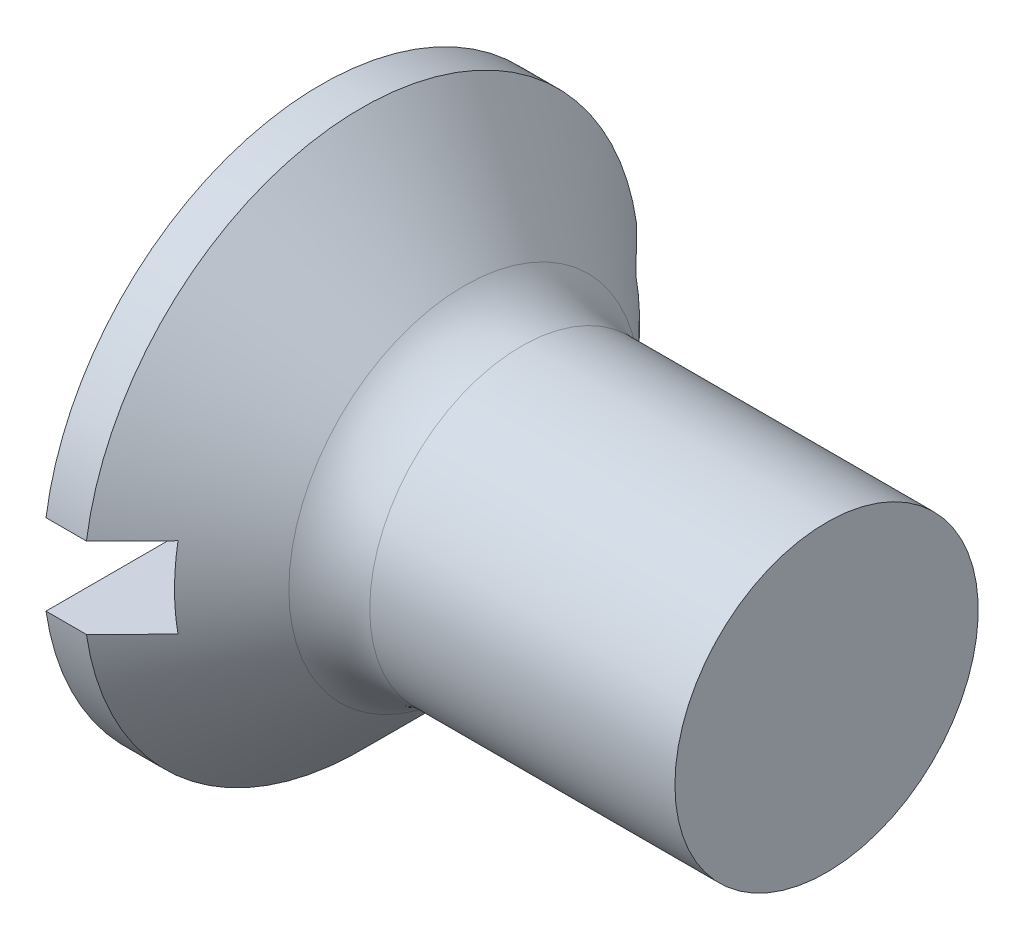
ISO-10303-21;
HEADER;
FILE_DESCRIPTION(('STEP AP214'),'2;1');
FILE_NAME('part.step','',(''),(''),'','','');
FILE_SCHEMA(('AUTOMOTIVE_DESIGN { 1 0 10303 214 1 1 1 1 }'));
ENDSEC;
DATA;
#1=APPLICATION_CONTEXT('core data for automotive mechanical design processes');
#2=APPLICATION_PROTOCOL_DEFINITION('international standard','automotive_design',2000,#1);
#3=PRODUCT_CONTEXT('',#1,'mechanical');
#4=PRODUCT('Part','Part','',(#3));
#5=PRODUCT_RELATED_PRODUCT_CATEGORY('part','',(#4));
#6=PRODUCT_DEFINITION_FORMATION('','',#4);
#7=PRODUCT_DEFINITION_CONTEXT('part definition',#1,'design');
#8=PRODUCT_DEFINITION('design','',#6,#7);
#9=PRODUCT_DEFINITION_SHAPE('','',#8);
#10=(LENGTH_UNIT() NAMED_UNIT(*) SI_UNIT(.MILLI.,.METRE.));
#11=(NAMED_UNIT(*) PLANE_ANGLE_UNIT() SI_UNIT($,.RADIAN.));
#12=(NAMED_UNIT(*) SI_UNIT($,.STERADIAN.) SOLID_ANGLE_UNIT());
#13=UNCERTAINTY_MEASURE_WITH_UNIT(LENGTH_MEASURE(1.E-05),#10,'distance_accuracy_value','');
#14=(GEOMETRIC_REPRESENTATION_CONTEXT(3) GLOBAL_UNCERTAINTY_ASSIGNED_CONTEXT((#13)) GLOBAL_UNIT_ASSIGNED_CONTEXT((#10,
#11,#12)) REPRESENTATION_CONTEXT('',''));
#15=CARTESIAN_POINT('',(0.,0.,0.));
#16=DIRECTION('',(0.,0.,1.));
#17=DIRECTION('',(1.,0.,0.));
#18=AXIS2_PLACEMENT_3D('',#15,#16,#17);
#19=CARTESIAN_POINT('',(0.85,-0.4,-2.75));
#20=DIRECTION('',(1.,0.,0.));
#21=DIRECTION('',(0.,0.,-1.));
#22=AXIS2_PLACEMENT_3D('',#19,#20,#21);
#23=PLANE('',#22);
#24=CARTESIAN_POINT('',(0.850000000014006,0.,0.));
#25=DIRECTION('',(-1.,0.,0.));
#26=DIRECTION('',(0.,0.,1.));
#27=AXIS2_PLACEMENT_3D('',#24,#25,#26);
#28=CIRCLE('',#27,2.30000000001627);
#29=CARTESIAN_POINT('',(0.850000000014577,0.4,2.26495033059717));
#30=VERTEX_POINT('',#29);
#31=CARTESIAN_POINT('',(0.850000000007003,-0.4,2.26495033060486));
#32=VERTEX_POINT('',#31);
#33=EDGE_CURVE('E81',#30,#32,#28,.F.);
#34=ORIENTED_EDGE('',*,*,#33,.F.);
#35=DIRECTION('',(0.,0.,1.));
#36=VECTOR('',#35,1.);
#37=CARTESIAN_POINT('',(0.85,0.4,2.75));
#38=LINE('',#37,#36);
#39=CARTESIAN_POINT('',(0.850000000007003,0.4,-2.26495033060486));
#40=VERTEX_POINT('',#39);
#41=EDGE_CURVE('E83',#30,#40,#38,.F.);
#42=ORIENTED_EDGE('',*,*,#41,.T.);
#43=CARTESIAN_POINT('',(0.850000000014006,0.,0.));
#44=DIRECTION('',(-1.,0.,0.));
#45=DIRECTION('',(0.,0.,1.));
#46=AXIS2_PLACEMENT_3D('',#43,#44,#45);
#47=CIRCLE('',#46,2.30000000001627);
#48=CARTESIAN_POINT('',(0.850000000014577,-0.4,-2.26495033059717));
#49=VERTEX_POINT('',#48);
#50=EDGE_CURVE('E19',#49,#40,#47,.F.);
#51=ORIENTED_EDGE('',*,*,#50,.F.);
#52=DIRECTION('',(0.,0.,-1.));
#53=VECTOR('',#52,1.);
#54=CARTESIAN_POINT('',(0.85,-0.4,-2.75));
#55=LINE('',#54,#53);
#56=EDGE_CURVE('E132',#49,#32,#55,.F.);
#57=ORIENTED_EDGE('',*,*,#56,.T.);
#58=EDGE_LOOP('',(#34,#42,#51,#57));
#59=FACE_BOUND('',#58,.T.);
#60=ADVANCED_FACE('F16',(#59),#23,.F.);
#61=CARTESIAN_POINT('',(0.85,-0.4,-2.75));
#62=DIRECTION('',(0.,-1.,0.));
#63=DIRECTION('',(0.,0.,-1.));
#64=AXIS2_PLACEMENT_3D('',#61,#62,#63);
#65=PLANE('',#64);
#66=CARTESIAN_POINT('',(0.850000000012787,-0.4,2.26495033059899));
#67=CARTESIAN_POINT('',(0.775087851754749,-0.4,2.34100427520643));
#68=CARTESIAN_POINT('',(0.700131776506393,-0.4,2.41701485209761));
#69=CARTESIAN_POINT('',(0.550131776498639,-0.4,2.56894926592026));
#70=CARTESIAN_POINT('',(0.475087851744474,-0.4,2.64487310285688));
#71=CARTESIAN_POINT('',(0.40000000000523,-0.4,2.72075357208242));
#72=B_SPLINE_CURVE_WITH_KNOTS('',3,(#66,#67,#68,#69,#70,#71),.UNSPECIFIED.,.F.,.F.,(4,2,4),(0.,
0.320256442782521,0.640512866479516),.UNSPECIFIED.);
#73=CARTESIAN_POINT('',(0.400000000009254,-0.4,2.72075357208249));
#74=VERTEX_POINT('',#73);
#75=EDGE_CURVE('E123',#32,#74,#72,.T.);
#76=ORIENTED_EDGE('',*,*,#75,.F.);
#77=ORIENTED_EDGE('',*,*,#56,.F.);
#78=CARTESIAN_POINT('',(0.40000000000523,-0.4,-2.72075357208242));
#79=CARTESIAN_POINT('',(0.475087851744869,-0.4,-2.64487310285648));
#80=CARTESIAN_POINT('',(0.550131776499427,-0.4,-2.56894926591946));
#81=CARTESIAN_POINT('',(0.700131776507969,-0.4,-2.41701485209602));
#82=CARTESIAN_POINT('',(0.775087851756716,-0.4,-2.34100427520443));
#83=CARTESIAN_POINT('',(0.850000000015147,-0.4,-2.26495033059659));
#84=B_SPLINE_CURVE_WITH_KNOTS('',3,(#78,#79,#80,#81,#82,#83),.UNSPECIFIED.,.F.,.F.,(4,2,4),(0.,
0.320256423698676,0.640512866482879),.UNSPECIFIED.);
#85=CARTESIAN_POINT('',(0.400000000009186,-0.4,-2.72075357207842));
#86=VERTEX_POINT('',#85);
#87=EDGE_CURVE('E76',#86,#49,#84,.T.);
#88=ORIENTED_EDGE('',*,*,#87,.F.);
#89=DIRECTION('',(1.,0.,0.));
#90=VECTOR('',#89,1.);
#91=CARTESIAN_POINT('',(0.85,-0.4,-2.72075357208256));
#92=LINE('',#91,#90);
#93=CARTESIAN_POINT('',(0.,-0.4,-2.72075357208256));
#94=VERTEX_POINT('',#93);
#95=EDGE_CURVE('E133',#94,#86,#92,.T.);
#96=ORIENTED_EDGE('',*,*,#95,.F.);
#97=DIRECTION('',(0.,0.,1.));
#98=VECTOR('',#97,1.);
#99=CARTESIAN_POINT('',(0.,-0.4,0.));
#100=LINE('',#99,#98);
#101=CARTESIAN_POINT('',(0.,-0.4,2.72075357208256));
#102=VERTEX_POINT('',#101);
#103=EDGE_CURVE('E95',#102,#94,#100,.F.);
#104=ORIENTED_EDGE('',*,*,#103,.F.);
#105=DIRECTION('',(1.,0.,0.));
#106=VECTOR('',#105,1.);
#107=CARTESIAN_POINT('',(0.85,-0.4,2.72075357208256));
#108=LINE('',#107,#106);
#109=EDGE_CURVE('E172',#74,#102,#108,.F.);
#110=ORIENTED_EDGE('',*,*,#109,.F.);
#111=EDGE_LOOP('',(#76,#77,#88,#96,#104,#110));
#112=FACE_BOUND('',#111,.T.);
#113=ADVANCED_FACE('F134',(#112),#65,.F.);
#114=CARTESIAN_POINT('',(0.85,0.4,2.75));
#115=DIRECTION('',(0.,1.,0.));
#116=DIRECTION('',(0.,0.,1.));
#117=AXIS2_PLACEMENT_3D('',#114,#115,#116);
#118=PLANE('',#117);
#119=CARTESIAN_POINT('',(0.850000000012787,0.4,-2.26495033059899));
#120=CARTESIAN_POINT('',(0.775087851754749,0.4,-2.34100427520643));
#121=CARTESIAN_POINT('',(0.700131776506393,0.4,-2.41701485209761));
#122=CARTESIAN_POINT('',(0.550131776498639,0.4,-2.56894926592026));
#123=CARTESIAN_POINT('',(0.475087851744475,0.4,-2.64487310285688));
#124=CARTESIAN_POINT('',(0.40000000000523,0.4,-2.72075357208242));
#125=B_SPLINE_CURVE_WITH_KNOTS('',3,(#119,#120,#121,#122,#123,#124),.UNSPECIFIED.,.F.,.F.,(4,2,
4),(0.,0.320256442782521,0.640512866479515),.UNSPECIFIED.);
#126=CARTESIAN_POINT('',(0.400000000009254,0.4,-2.72075357208249));
#127=VERTEX_POINT('',#126);
#128=EDGE_CURVE('E72',#40,#127,#125,.T.);
#129=ORIENTED_EDGE('',*,*,#128,.F.);
#130=ORIENTED_EDGE('',*,*,#41,.F.);
#131=CARTESIAN_POINT('',(0.40000000000523,0.4,2.72075357208242));
#132=CARTESIAN_POINT('',(0.475087851744869,0.4,2.64487310285648));
#133=CARTESIAN_POINT('',(0.550131776499427,0.4,2.56894926591946));
#134=CARTESIAN_POINT('',(0.700131776507968,0.4,2.41701485209602));
#135=CARTESIAN_POINT('',(0.775087851756716,0.4,2.34100427520443));
#136=CARTESIAN_POINT('',(0.850000000015147,0.4,2.26495033059659));
#137=B_SPLINE_CURVE_WITH_KNOTS('',3,(#131,#132,#133,#134,#135,#136),.UNSPECIFIED.,.F.,.F.,(4,2,
4),(0.,0.320256423698676,0.640512866482879),.UNSPECIFIED.);
#138=CARTESIAN_POINT('',(0.400000000009186,0.4,2.72075357207842));
#139=VERTEX_POINT('',#138);
#140=EDGE_CURVE('E86',#139,#30,#137,.T.);
#141=ORIENTED_EDGE('',*,*,#140,.F.);
#142=DIRECTION('',(1.,0.,0.));
#143=VECTOR('',#142,1.);
#144=CARTESIAN_POINT('',(0.85,0.4,2.72075357208256));
#145=LINE('',#144,#143);
#146=CARTESIAN_POINT('',(0.,0.4,2.72075357208256));
#147=VERTEX_POINT('',#146);
#148=EDGE_CURVE('E35',#147,#139,#145,.T.);
#149=ORIENTED_EDGE('',*,*,#148,.F.);
#150=DIRECTION('',(0.,0.,1.));
#151=VECTOR('',#150,1.);
#152=CARTESIAN_POINT('',(0.,0.4,0.));
#153=LINE('',#152,#151);
#154=CARTESIAN_POINT('',(0.,0.4,-2.72075357208256));
#155=VERTEX_POINT('',#154);
#156=EDGE_CURVE('E164',#155,#147,#153,.T.);
#157=ORIENTED_EDGE('',*,*,#156,.F.);
#158=DIRECTION('',(1.,0.,0.));
#159=VECTOR('',#158,1.);
#160=CARTESIAN_POINT('',(0.85,0.4,-2.72075357208256));
#161=LINE('',#160,#159);
#162=EDGE_CURVE('E90',#127,#155,#161,.F.);
#163=ORIENTED_EDGE('',*,*,#162,.F.);
#164=EDGE_LOOP('',(#129,#130,#141,#149,#157,#163));
#165=FACE_BOUND('',#164,.T.);
#166=ADVANCED_FACE('F89',(#165),#118,.F.);
#167=CARTESIAN_POINT('',(0.,0.,0.));
#168=DIRECTION('',(-1.,0.,0.));
#169=DIRECTION('',(0.,0.,1.));
#170=AXIS2_PLACEMENT_3D('',#167,#168,#169);
#171=PLANE('',#170);
#172=ORIENTED_EDGE('',*,*,#103,.T.);
#173=CARTESIAN_POINT('',(0.,0.,0.));
#174=DIRECTION('',(-1.,0.,0.));
#175=DIRECTION('',(0.,0.,1.));
#176=AXIS2_PLACEMENT_3D('',#173,#174,#175);
#177=CIRCLE('',#176,2.75);
#178=EDGE_CURVE('E104',#102,#94,#177,.F.);
#179=ORIENTED_EDGE('',*,*,#178,.F.);
#180=EDGE_LOOP('',(#172,#179));
#181=FACE_BOUND('',#180,.T.);
#182=ADVANCED_FACE('F144',(#181),#171,.T.);
#183=CARTESIAN_POINT('',(0.,0.,0.));
#184=DIRECTION('',(-1.,0.,0.));
#185=DIRECTION('',(0.,0.,1.));
#186=AXIS2_PLACEMENT_3D('',#183,#184,#185);
#187=PLANE('',#186);
#188=ORIENTED_EDGE('',*,*,#156,.T.);
#189=CARTESIAN_POINT('',(0.,0.,0.));
#190=DIRECTION('',(-1.,0.,0.));
#191=DIRECTION('',(0.,0.,1.));
#192=AXIS2_PLACEMENT_3D('',#189,#190,#191);
#193=CIRCLE('',#192,2.75);
#194=EDGE_CURVE('E182',#155,#147,#193,.F.);
#195=ORIENTED_EDGE('',*,*,#194,.F.);
#196=EDGE_LOOP('',(#188,#195));
#197=FACE_BOUND('',#196,.T.);
#198=ADVANCED_FACE('F206',(#197),#187,.T.);
#199=CARTESIAN_POINT('',(-6.34999999999999,0.,0.));
#200=DIRECTION('',(-1.,0.,0.));
#201=DIRECTION('',(0.,0.,1.));
#202=AXIS2_PLACEMENT_3D('',#199,#200,#201);
#203=CYLINDRICAL_SURFACE('',#202,2.75);
#204=ORIENTED_EDGE('',*,*,#95,.T.);
#205=CARTESIAN_POINT('',(0.400000000013279,0.,0.));
#206=DIRECTION('',(-1.,0.,0.));
#207=DIRECTION('',(0.,0.,1.));
#208=AXIS2_PLACEMENT_3D('',#205,#206,#207);
#209=CIRCLE('',#208,2.74999999999181);
#210=EDGE_CURVE('E178',#74,#86,#209,.F.);
#211=ORIENTED_EDGE('',*,*,#210,.F.);
#212=ORIENTED_EDGE('',*,*,#109,.T.);
#213=ORIENTED_EDGE('',*,*,#178,.T.);
#214=EDGE_LOOP('',(#204,#211,#212,#213));
#215=FACE_BOUND('',#214,.T.);
#216=ADVANCED_FACE('F195',(#215),#203,.T.);
#217=CARTESIAN_POINT('',(-6.34999999999999,0.,0.));
#218=DIRECTION('',(-1.,0.,0.));
#219=DIRECTION('',(0.,0.,1.));
#220=AXIS2_PLACEMENT_3D('',#217,#218,#219);
#221=CYLINDRICAL_SURFACE('',#220,2.75);
#222=ORIENTED_EDGE('',*,*,#148,.T.);
#223=CARTESIAN_POINT('',(0.400000000013279,0.,0.));
#224=DIRECTION('',(-1.,0.,0.));
#225=DIRECTION('',(0.,0.,1.));
#226=AXIS2_PLACEMENT_3D('',#223,#224,#225);
#227=CIRCLE('',#226,2.74999999999181);
#228=EDGE_CURVE('E163',#127,#139,#227,.F.);
#229=ORIENTED_EDGE('',*,*,#228,.F.);
#230=ORIENTED_EDGE('',*,*,#162,.T.);
#231=ORIENTED_EDGE('',*,*,#194,.T.);
#232=EDGE_LOOP('',(#222,#229,#230,#231));
#233=FACE_BOUND('',#232,.T.);
#234=ADVANCED_FACE('F117',(#233),#221,.T.);
#235=CARTESIAN_POINT('',(0.400000000013279,0.,0.));
#236=DIRECTION('',(-1.,0.,0.));
#237=DIRECTION('',(0.,0.,1.));
#238=AXIS2_PLACEMENT_3D('',#235,#236,#237);
#239=CONICAL_SURFACE('',#238,2.74999999999181,0.785398163369466);
#240=ORIENTED_EDGE('',*,*,#87,.T.);
#241=ORIENTED_EDGE('',*,*,#50,.T.);
#242=ORIENTED_EDGE('',*,*,#128,.T.);
#243=ORIENTED_EDGE('',*,*,#228,.T.);
#244=ORIENTED_EDGE('',*,*,#140,.T.);
#245=ORIENTED_EDGE('',*,*,#33,.T.);
#246=ORIENTED_EDGE('',*,*,#75,.T.);
#247=ORIENTED_EDGE('',*,*,#210,.T.);
#248=EDGE_LOOP('',(#240,#241,#242,#243,#244,#245,#246,#247));
#249=FACE_BOUND('',#248,.T.);
#250=CARTESIAN_POINT('',(1.41568542494924,0.,0.));
#251=DIRECTION('',(-1.,0.,0.));
#252=DIRECTION('',(0.,0.,1.));
#253=AXIS2_PLACEMENT_3D('',#250,#251,#252);
#254=CIRCLE('',#253,1.73431457505076);
#255=CARTESIAN_POINT('',(1.41568542494924,0.,1.73431457505076));
#256=VERTEX_POINT('',#255);
#257=EDGE_CURVE('E159',#256,#256,#254,.T.);
#258=ORIENTED_EDGE('',*,*,#257,.T.);
#259=EDGE_LOOP('',(#258));
#260=FACE_BOUND('',#259,.T.);
#261=ADVANCED_FACE('F68',(#249,#260),#239,.T.);
#262=CARTESIAN_POINT('',(5.,1.5,0.));
#263=DIRECTION('',(1.,0.,0.));
#264=DIRECTION('',(0.,0.,-1.));
#265=AXIS2_PLACEMENT_3D('',#262,#263,#264);
#266=PLANE('',#265);
#267=CARTESIAN_POINT('',(5.,0.,0.));
#268=DIRECTION('',(-1.,0.,0.));
#269=DIRECTION('',(0.,0.,1.));
#270=AXIS2_PLACEMENT_3D('',#267,#268,#269);
#271=CIRCLE('',#270,1.5);
#272=CARTESIAN_POINT('',(5.,0.,1.5));
#273=VERTEX_POINT('',#272);
#274=EDGE_CURVE('E26',#273,#273,#271,.T.);
#275=ORIENTED_EDGE('',*,*,#274,.F.);
#276=EDGE_LOOP('',(#275));
#277=FACE_BOUND('',#276,.T.);
#278=ADVANCED_FACE('F116',(#277),#266,.T.);
#279=CARTESIAN_POINT('',(1.98137084989848,0.,0.));
#280=DIRECTION('',(-1.,0.,0.));
#281=DIRECTION('',(0.,0.,1.));
#282=AXIS2_PLACEMENT_3D('',#279,#280,#281);
#283=TOROIDAL_SURFACE('',#282,2.3,0.8);
#284=ORIENTED_EDGE('',*,*,#257,.F.);
#285=EDGE_LOOP('',(#284));
#286=FACE_BOUND('',#285,.T.);
#287=CARTESIAN_POINT('',(1.98137084989848,0.,0.));
#288=DIRECTION('',(-1.,0.,0.));
#289=DIRECTION('',(0.,0.,1.));
#290=AXIS2_PLACEMENT_3D('',#287,#288,#289);
#291=CIRCLE('',#290,1.5);
#292=CARTESIAN_POINT('',(1.98137084989848,0.,1.5));
#293=VERTEX_POINT('',#292);
#294=EDGE_CURVE('E11',#293,#293,#291,.F.);
#295=ORIENTED_EDGE('',*,*,#294,.F.);
#296=EDGE_LOOP('',(#295));
#297=FACE_BOUND('',#296,.T.);
#298=ADVANCED_FACE('F148',(#286,#297),#283,.F.);
#299=CARTESIAN_POINT('',(-6.34999999999999,0.,0.));
#300=DIRECTION('',(-1.,0.,0.));
#301=DIRECTION('',(0.,0.,1.));
#302=AXIS2_PLACEMENT_3D('',#299,#300,#301);
#303=CYLINDRICAL_SURFACE('',#302,1.5);
#304=ORIENTED_EDGE('',*,*,#294,.T.);
#305=EDGE_LOOP('',(#304));
#306=FACE_BOUND('',#305,.T.);
#307=ORIENTED_EDGE('',*,*,#274,.T.);
#308=EDGE_LOOP('',(#307));
#309=FACE_BOUND('',#308,.T.);
#310=ADVANCED_FACE('F146',(#306,#309),#303,.T.);
#311=CLOSED_SHELL('',(#60,#113,#166,#182,#198,#216,#234,#261,#278,#298,#310));
#312=MANIFOLD_SOLID_BREP('B1',#311);
#313=ADVANCED_BREP_SHAPE_REPRESENTATION('',(#18,#312),#14);
#314=SHAPE_DEFINITION_REPRESENTATION(#9,#313);
ENDSEC;
END-ISO-10303-21;
